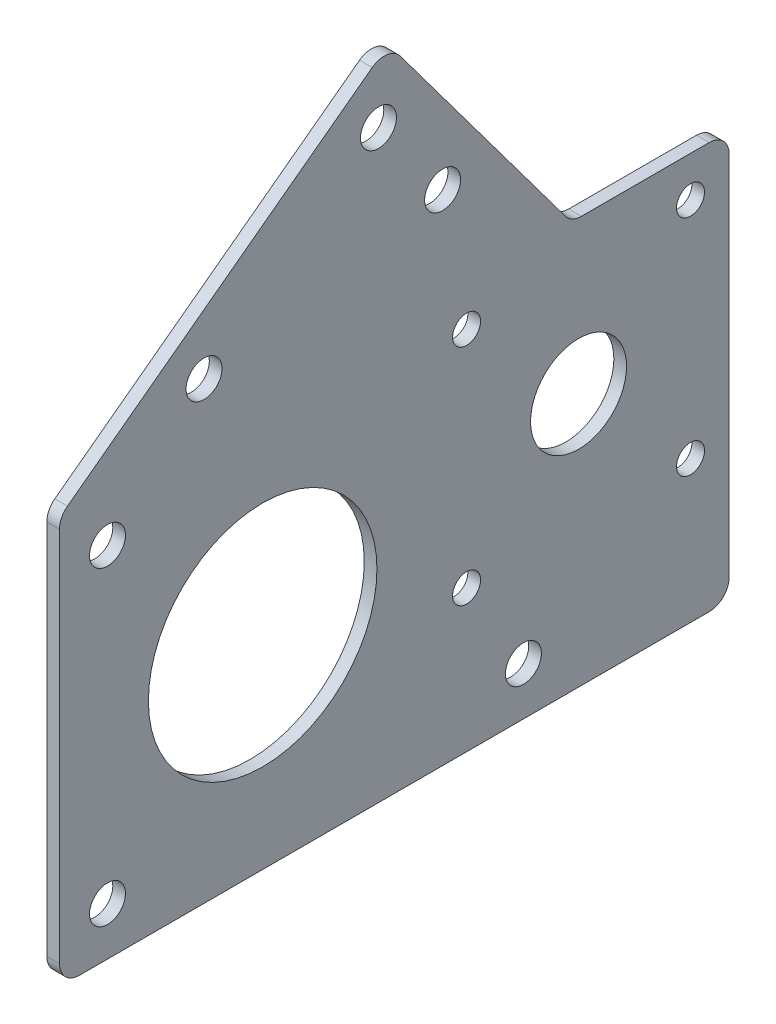
ISO-10303-21;
HEADER;
FILE_DESCRIPTION(('STEP AP214'),'2;1');
FILE_NAME('part.step','',(''),(''),'','','');
FILE_SCHEMA(('AUTOMOTIVE_DESIGN { 1 0 10303 214 1 1 1 1 }'));
ENDSEC;
DATA;
#1=APPLICATION_CONTEXT('core data for automotive mechanical design processes');
#2=APPLICATION_PROTOCOL_DEFINITION('international standard','automotive_design',2000,#1);
#3=PRODUCT_CONTEXT('',#1,'mechanical');
#4=PRODUCT('Part','Part','',(#3));
#5=PRODUCT_RELATED_PRODUCT_CATEGORY('part','',(#4));
#6=PRODUCT_DEFINITION_FORMATION('','',#4);
#7=PRODUCT_DEFINITION_CONTEXT('part definition',#1,'design');
#8=PRODUCT_DEFINITION('design','',#6,#7);
#9=PRODUCT_DEFINITION_SHAPE('','',#8);
#10=(LENGTH_UNIT() NAMED_UNIT(*) SI_UNIT(.MILLI.,.METRE.));
#11=(NAMED_UNIT(*) PLANE_ANGLE_UNIT() SI_UNIT($,.RADIAN.));
#12=(NAMED_UNIT(*) SI_UNIT($,.STERADIAN.) SOLID_ANGLE_UNIT());
#13=UNCERTAINTY_MEASURE_WITH_UNIT(LENGTH_MEASURE(1.E-05),#10,'distance_accuracy_value','');
#14=(GEOMETRIC_REPRESENTATION_CONTEXT(3) GLOBAL_UNCERTAINTY_ASSIGNED_CONTEXT((#13)) GLOBAL_UNIT_ASSIGNED_CONTEXT((#10,
#11,#12)) REPRESENTATION_CONTEXT('',''));
#15=CARTESIAN_POINT('',(0.,0.,0.));
#16=DIRECTION('',(0.,0.,1.));
#17=DIRECTION('',(1.,0.,0.));
#18=AXIS2_PLACEMENT_3D('',#15,#16,#17);
#19=CARTESIAN_POINT('',(1.5875,-22.9,22.9));
#20=DIRECTION('',(-1.,0.,0.));
#21=DIRECTION('',(0.,0.,1.));
#22=AXIS2_PLACEMENT_3D('',#19,#20,#21);
#23=CYLINDRICAL_SURFACE('',#22,2.5);
#24=CARTESIAN_POINT('',(0.,-22.9,22.9));
#25=DIRECTION('',(1.,0.,0.));
#26=DIRECTION('',(0.,0.,-1.));
#27=AXIS2_PLACEMENT_3D('',#24,#25,#26);
#28=CIRCLE('',#27,2.5);
#29=CARTESIAN_POINT('',(0.,-22.9,25.4));
#30=VERTEX_POINT('',#29);
#31=CARTESIAN_POINT('',(0.,-25.4,22.9));
#32=VERTEX_POINT('',#31);
#33=EDGE_CURVE('E199',#30,#32,#28,.T.);
#34=ORIENTED_EDGE('',*,*,#33,.T.);
#35=DIRECTION('',(-1.,0.,0.));
#36=VECTOR('',#35,1.);
#37=CARTESIAN_POINT('',(1.5875,-25.4,22.9));
#38=LINE('',#37,#36);
#39=CARTESIAN_POINT('',(1.5875,-25.4,22.9));
#40=VERTEX_POINT('',#39);
#41=EDGE_CURVE('E11',#40,#32,#38,.T.);
#42=ORIENTED_EDGE('',*,*,#41,.F.);
#43=CARTESIAN_POINT('',(1.5875,-22.9,22.9));
#44=DIRECTION('',(1.,0.,0.));
#45=DIRECTION('',(0.,0.,-1.));
#46=AXIS2_PLACEMENT_3D('',#43,#44,#45);
#47=CIRCLE('',#46,2.5);
#48=CARTESIAN_POINT('',(1.5875,-22.9,25.4));
#49=VERTEX_POINT('',#48);
#50=EDGE_CURVE('E617',#49,#40,#47,.T.);
#51=ORIENTED_EDGE('',*,*,#50,.F.);
#52=DIRECTION('',(-1.,0.,0.));
#53=VECTOR('',#52,1.);
#54=CARTESIAN_POINT('',(1.5875,-22.9,25.4));
#55=LINE('',#54,#53);
#56=EDGE_CURVE('E192',#49,#30,#55,.T.);
#57=ORIENTED_EDGE('',*,*,#56,.T.);
#58=EDGE_LOOP('',(#34,#42,#51,#57));
#59=FACE_BOUND('',#58,.T.);
#60=ADVANCED_FACE('F39',(#59),#23,.T.);
#61=CARTESIAN_POINT('',(1.5875,-25.4,0.));
#62=DIRECTION('',(0.,1.,0.));
#63=DIRECTION('',(0.,0.,1.));
#64=AXIS2_PLACEMENT_3D('',#61,#62,#63);
#65=PLANE('',#64);
#66=DIRECTION('',(0.,0.,-1.));
#67=VECTOR('',#66,1.);
#68=CARTESIAN_POINT('',(0.,-25.4,0.));
#69=LINE('',#68,#67);
#70=CARTESIAN_POINT('',(0.,-25.4,-55.825));
#71=VERTEX_POINT('',#70);
#72=EDGE_CURVE('E202',#32,#71,#69,.T.);
#73=ORIENTED_EDGE('',*,*,#72,.T.);
#74=DIRECTION('',(-1.,0.,0.));
#75=VECTOR('',#74,1.);
#76=CARTESIAN_POINT('',(1.5875,-25.4,-55.825));
#77=LINE('',#76,#75);
#78=CARTESIAN_POINT('',(1.5875,-25.4,-55.825));
#79=VERTEX_POINT('',#78);
#80=EDGE_CURVE('E48',#79,#71,#77,.T.);
#81=ORIENTED_EDGE('',*,*,#80,.F.);
#82=DIRECTION('',(0.,0.,-1.));
#83=VECTOR('',#82,1.);
#84=CARTESIAN_POINT('',(1.5875,-25.4,0.));
#85=LINE('',#84,#83);
#86=EDGE_CURVE('E110',#40,#79,#85,.T.);
#87=ORIENTED_EDGE('',*,*,#86,.F.);
#88=ORIENTED_EDGE('',*,*,#41,.T.);
#89=EDGE_LOOP('',(#73,#81,#87,#88));
#90=FACE_BOUND('',#89,.T.);
#91=ADVANCED_FACE('F326',(#90),#65,.F.);
#92=CARTESIAN_POINT('',(1.5875,-22.9,-55.825));
#93=DIRECTION('',(-1.,0.,0.));
#94=DIRECTION('',(0.,0.,1.));
#95=AXIS2_PLACEMENT_3D('',#92,#93,#94);
#96=CYLINDRICAL_SURFACE('',#95,2.5);
#97=CARTESIAN_POINT('',(0.,-22.9,-55.825));
#98=DIRECTION('',(1.,0.,0.));
#99=DIRECTION('',(0.,0.,-1.));
#100=AXIS2_PLACEMENT_3D('',#97,#98,#99);
#101=CIRCLE('',#100,2.5);
#102=CARTESIAN_POINT('',(0.,-22.9,-58.325));
#103=VERTEX_POINT('',#102);
#104=EDGE_CURVE('E204',#71,#103,#101,.T.);
#105=ORIENTED_EDGE('',*,*,#104,.T.);
#106=DIRECTION('',(-1.,0.,0.));
#107=VECTOR('',#106,1.);
#108=CARTESIAN_POINT('',(1.5875,-22.9,-58.325));
#109=LINE('',#108,#107);
#110=CARTESIAN_POINT('',(1.5875,-22.9,-58.325));
#111=VERTEX_POINT('',#110);
#112=EDGE_CURVE('E271',#111,#103,#109,.T.);
#113=ORIENTED_EDGE('',*,*,#112,.F.);
#114=CARTESIAN_POINT('',(1.5875,-22.9,-55.825));
#115=DIRECTION('',(1.,0.,0.));
#116=DIRECTION('',(0.,0.,-1.));
#117=AXIS2_PLACEMENT_3D('',#114,#115,#116);
#118=CIRCLE('',#117,2.5);
#119=EDGE_CURVE('E279',#79,#111,#118,.T.);
#120=ORIENTED_EDGE('',*,*,#119,.F.);
#121=ORIENTED_EDGE('',*,*,#80,.T.);
#122=EDGE_LOOP('',(#105,#113,#120,#121));
#123=FACE_BOUND('',#122,.T.);
#124=ADVANCED_FACE('F277',(#123),#96,.T.);
#125=CARTESIAN_POINT('',(1.5875,0.,-58.325));
#126=DIRECTION('',(0.,0.,1.));
#127=DIRECTION('',(1.,0.,0.));
#128=AXIS2_PLACEMENT_3D('',#125,#126,#127);
#129=PLANE('',#128);
#130=DIRECTION('',(0.,1.,0.));
#131=VECTOR('',#130,1.);
#132=CARTESIAN_POINT('',(0.,0.,-58.325));
#133=LINE('',#132,#131);
#134=CARTESIAN_POINT('',(0.,22.9,-58.325));
#135=VERTEX_POINT('',#134);
#136=EDGE_CURVE('E206',#103,#135,#133,.T.);
#137=ORIENTED_EDGE('',*,*,#136,.T.);
#138=DIRECTION('',(-1.,0.,0.));
#139=VECTOR('',#138,1.);
#140=CARTESIAN_POINT('',(1.5875,22.9,-58.325));
#141=LINE('',#140,#139);
#142=CARTESIAN_POINT('',(1.5875,22.9,-58.325));
#143=VERTEX_POINT('',#142);
#144=EDGE_CURVE('E269',#143,#135,#141,.T.);
#145=ORIENTED_EDGE('',*,*,#144,.F.);
#146=DIRECTION('',(0.,1.,0.));
#147=VECTOR('',#146,1.);
#148=CARTESIAN_POINT('',(1.5875,0.,-58.325));
#149=LINE('',#148,#147);
#150=EDGE_CURVE('E291',#111,#143,#149,.T.);
#151=ORIENTED_EDGE('',*,*,#150,.F.);
#152=ORIENTED_EDGE('',*,*,#112,.T.);
#153=EDGE_LOOP('',(#137,#145,#151,#152));
#154=FACE_BOUND('',#153,.T.);
#155=ADVANCED_FACE('F288',(#154),#129,.F.);
#156=CARTESIAN_POINT('',(1.5875,22.9,-55.825));
#157=DIRECTION('',(-1.,0.,0.));
#158=DIRECTION('',(0.,0.,1.));
#159=AXIS2_PLACEMENT_3D('',#156,#157,#158);
#160=CYLINDRICAL_SURFACE('',#159,2.5);
#161=CARTESIAN_POINT('',(0.,22.9,-55.825));
#162=DIRECTION('',(1.,0.,0.));
#163=DIRECTION('',(0.,0.,-1.));
#164=AXIS2_PLACEMENT_3D('',#161,#162,#163);
#165=CIRCLE('',#164,2.5);
#166=CARTESIAN_POINT('',(0.,25.4,-55.825));
#167=VERTEX_POINT('',#166);
#168=EDGE_CURVE('E209',#167,#135,#165,.F.);
#169=ORIENTED_EDGE('',*,*,#168,.F.);
#170=DIRECTION('',(-1.,0.,0.));
#171=VECTOR('',#170,1.);
#172=CARTESIAN_POINT('',(1.5875,25.4,-55.825));
#173=LINE('',#172,#171);
#174=CARTESIAN_POINT('',(1.5875,25.4,-55.825));
#175=VERTEX_POINT('',#174);
#176=EDGE_CURVE('E267',#175,#167,#173,.T.);
#177=ORIENTED_EDGE('',*,*,#176,.F.);
#178=CARTESIAN_POINT('',(1.5875,22.9,-55.825));
#179=DIRECTION('',(1.,0.,0.));
#180=DIRECTION('',(0.,0.,-1.));
#181=AXIS2_PLACEMENT_3D('',#178,#179,#180);
#182=CIRCLE('',#181,2.5);
#183=EDGE_CURVE('E293',#175,#143,#182,.F.);
#184=ORIENTED_EDGE('',*,*,#183,.T.);
#185=ORIENTED_EDGE('',*,*,#144,.T.);
#186=EDGE_LOOP('',(#169,#177,#184,#185));
#187=FACE_BOUND('',#186,.T.);
#188=ADVANCED_FACE('F520',(#187),#160,.T.);
#189=CARTESIAN_POINT('',(1.5875,25.4,0.));
#190=DIRECTION('',(0.,1.,0.));
#191=DIRECTION('',(0.,0.,1.));
#192=AXIS2_PLACEMENT_3D('',#189,#190,#191);
#193=PLANE('',#192);
#194=DIRECTION('',(0.,0.,-1.));
#195=VECTOR('',#194,1.);
#196=CARTESIAN_POINT('',(0.,25.4,0.));
#197=LINE('',#196,#195);
#198=CARTESIAN_POINT('',(0.,25.4,-39.8535149472255));
#199=VERTEX_POINT('',#198);
#200=EDGE_CURVE('E212',#199,#167,#197,.T.);
#201=ORIENTED_EDGE('',*,*,#200,.F.);
#202=DIRECTION('',(-1.,0.,0.));
#203=VECTOR('',#202,1.);
#204=CARTESIAN_POINT('',(1.5875,25.4,-39.8535149472255));
#205=LINE('',#204,#203);
#206=CARTESIAN_POINT('',(1.5875,25.4,-39.8535149472255));
#207=VERTEX_POINT('',#206);
#208=EDGE_CURVE('E265',#207,#199,#205,.T.);
#209=ORIENTED_EDGE('',*,*,#208,.F.);
#210=DIRECTION('',(0.,0.,-1.));
#211=VECTOR('',#210,1.);
#212=CARTESIAN_POINT('',(1.5875,25.4,0.));
#213=LINE('',#212,#211);
#214=EDGE_CURVE('E295',#207,#175,#213,.T.);
#215=ORIENTED_EDGE('',*,*,#214,.T.);
#216=ORIENTED_EDGE('',*,*,#176,.T.);
#217=EDGE_LOOP('',(#201,#209,#215,#216));
#218=FACE_BOUND('',#217,.T.);
#219=ADVANCED_FACE('F512',(#218),#193,.T.);
#220=CARTESIAN_POINT('',(1.5875,27.9,-39.8535149472255));
#221=DIRECTION('',(-1.,0.,0.));
#222=DIRECTION('',(0.,0.,1.));
#223=AXIS2_PLACEMENT_3D('',#220,#221,#222);
#224=CYLINDRICAL_SURFACE('',#223,2.49999999999999);
#225=CARTESIAN_POINT('',(0.,27.9,-39.8535149472255));
#226=DIRECTION('',(1.,0.,0.));
#227=DIRECTION('',(0.,0.,-1.));
#228=AXIS2_PLACEMENT_3D('',#225,#226,#227);
#229=CIRCLE('',#228,2.49999999999999);
#230=CARTESIAN_POINT('',(0.,26.4045003890553,-37.8501475536444));
#231=VERTEX_POINT('',#230);
#232=EDGE_CURVE('E215',#231,#199,#229,.T.);
#233=ORIENTED_EDGE('',*,*,#232,.F.);
#234=DIRECTION('',(-1.,0.,0.));
#235=VECTOR('',#234,1.);
#236=CARTESIAN_POINT('',(1.5875,26.4045003890553,-37.8501475536444));
#237=LINE('',#236,#235);
#238=CARTESIAN_POINT('',(1.5875,26.4045003890553,-37.8501475536444));
#239=VERTEX_POINT('',#238);
#240=EDGE_CURVE('E263',#239,#231,#237,.T.);
#241=ORIENTED_EDGE('',*,*,#240,.F.);
#242=CARTESIAN_POINT('',(1.5875,27.9,-39.8535149472255));
#243=DIRECTION('',(1.,0.,0.));
#244=DIRECTION('',(0.,0.,-1.));
#245=AXIS2_PLACEMENT_3D('',#242,#243,#244);
#246=CIRCLE('',#245,2.49999999999999);
#247=EDGE_CURVE('E302',#239,#207,#246,.T.);
#248=ORIENTED_EDGE('',*,*,#247,.T.);
#249=ORIENTED_EDGE('',*,*,#208,.T.);
#250=EDGE_LOOP('',(#233,#241,#248,#249));
#251=FACE_BOUND('',#250,.T.);
#252=ADVANCED_FACE('F312',(#251),#224,.F.);
#253=CARTESIAN_POINT('',(1.5875,27.5927267006994,-36.9631450036021));
#254=DIRECTION('',(0.,0.598199844377869,-0.80134695743248));
#255=DIRECTION('',(0.,0.80134695743248,0.598199844377869));
#256=AXIS2_PLACEMENT_3D('',#253,#254,#255);
#257=PLANE('',#256);
#258=DIRECTION('',(0.,-0.80134695743248,-0.598199844377869));
#259=VECTOR('',#258,1.);
#260=CARTESIAN_POINT('',(0.,27.5927267006994,-36.9631450036021));
#261=LINE('',#260,#259);
#262=CARTESIAN_POINT('',(0.,54.0760326210612,-17.1935441668675));
#263=VERTEX_POINT('',#262);
#264=EDGE_CURVE('E218',#263,#231,#261,.T.);
#265=ORIENTED_EDGE('',*,*,#264,.F.);
#266=DIRECTION('',(-1.,0.,0.));
#267=VECTOR('',#266,1.);
#268=CARTESIAN_POINT('',(1.5875,54.0760326210612,-17.1935441668675));
#269=LINE('',#268,#267);
#270=CARTESIAN_POINT('',(1.5875,54.0760326210612,-17.1935441668675));
#271=VERTEX_POINT('',#270);
#272=EDGE_CURVE('E261',#271,#263,#269,.T.);
#273=ORIENTED_EDGE('',*,*,#272,.F.);
#274=DIRECTION('',(0.,-0.80134695743248,-0.598199844377869));
#275=VECTOR('',#274,1.);
#276=CARTESIAN_POINT('',(1.5875,27.5927267006994,-36.9631450036021));
#277=LINE('',#276,#275);
#278=EDGE_CURVE('E157',#271,#239,#277,.T.);
#279=ORIENTED_EDGE('',*,*,#278,.T.);
#280=ORIENTED_EDGE('',*,*,#240,.T.);
#281=EDGE_LOOP('',(#265,#273,#279,#280));
#282=FACE_BOUND('',#281,.T.);
#283=ADVANCED_FACE('F307',(#282),#257,.T.);
#284=CARTESIAN_POINT('',(1.5875,52.5805330101165,-15.1901767732863));
#285=DIRECTION('',(-1.,0.,0.));
#286=DIRECTION('',(0.,0.,1.));
#287=AXIS2_PLACEMENT_3D('',#284,#285,#286);
#288=CYLINDRICAL_SURFACE('',#287,2.5);
#289=CARTESIAN_POINT('',(0.,52.5805330101165,-15.1901767732863));
#290=DIRECTION('',(1.,0.,0.));
#291=DIRECTION('',(0.,0.,-1.));
#292=AXIS2_PLACEMENT_3D('',#289,#290,#291);
#293=CIRCLE('',#292,2.5);
#294=CARTESIAN_POINT('',(0.,54.5839004036977,-13.6946771623416));
#295=VERTEX_POINT('',#294);
#296=EDGE_CURVE('E221',#263,#295,#293,.T.);
#297=ORIENTED_EDGE('',*,*,#296,.T.);
#298=DIRECTION('',(-1.,0.,0.));
#299=VECTOR('',#298,1.);
#300=CARTESIAN_POINT('',(1.5875,54.5839004036977,-13.6946771623416));
#301=LINE('',#300,#299);
#302=CARTESIAN_POINT('',(1.5875,54.5839004036977,-13.6946771623416));
#303=VERTEX_POINT('',#302);
#304=EDGE_CURVE('E144',#303,#295,#301,.T.);
#305=ORIENTED_EDGE('',*,*,#304,.F.);
#306=CARTESIAN_POINT('',(1.5875,52.5805330101165,-15.1901767732863));
#307=DIRECTION('',(1.,0.,0.));
#308=DIRECTION('',(0.,0.,-1.));
#309=AXIS2_PLACEMENT_3D('',#306,#307,#308);
#310=CIRCLE('',#309,2.5);
#311=EDGE_CURVE('E154',#271,#303,#310,.T.);
#312=ORIENTED_EDGE('',*,*,#311,.F.);
#313=ORIENTED_EDGE('',*,*,#272,.T.);
#314=EDGE_LOOP('',(#297,#305,#312,#313));
#315=FACE_BOUND('',#314,.T.);
#316=ADVANCED_FACE('F316',(#315),#288,.T.);
#317=CARTESIAN_POINT('',(1.5875,28.4866733139431,21.2651004476793));
#318=DIRECTION('',(0.,0.801346957432481,0.598199844377868));
#319=DIRECTION('',(0.,-0.598199844377868,0.801346957432481));
#320=AXIS2_PLACEMENT_3D('',#317,#318,#319);
#321=PLANE('',#320);
#322=DIRECTION('',(0.,0.598199844377868,-0.801346957432481));
#323=VECTOR('',#322,1.);
#324=CARTESIAN_POINT('',(0.,28.4866733139431,21.2651004476793));
#325=LINE('',#324,#323);
#326=CARTESIAN_POINT('',(0.,26.1498524463557,24.3954996109447));
#327=VERTEX_POINT('',#326);
#328=EDGE_CURVE('E143',#327,#295,#325,.T.);
#329=ORIENTED_EDGE('',*,*,#328,.F.);
#330=DIRECTION('',(-1.,0.,0.));
#331=VECTOR('',#330,1.);
#332=CARTESIAN_POINT('',(1.5875,26.1498524463557,24.3954996109447));
#333=LINE('',#332,#331);
#334=CARTESIAN_POINT('',(1.5875,26.1498524463557,24.3954996109447));
#335=VERTEX_POINT('',#334);
#336=EDGE_CURVE('E137',#335,#327,#333,.T.);
#337=ORIENTED_EDGE('',*,*,#336,.F.);
#338=DIRECTION('',(0.,0.598199844377868,-0.801346957432481));
#339=VECTOR('',#338,1.);
#340=CARTESIAN_POINT('',(1.5875,28.4866733139431,21.2651004476793));
#341=LINE('',#340,#339);
#342=EDGE_CURVE('E141',#335,#303,#341,.T.);
#343=ORIENTED_EDGE('',*,*,#342,.T.);
#344=ORIENTED_EDGE('',*,*,#304,.T.);
#345=EDGE_LOOP('',(#329,#337,#343,#344));
#346=FACE_BOUND('',#345,.T.);
#347=ADVANCED_FACE('F139',(#346),#321,.T.);
#348=CARTESIAN_POINT('',(1.5875,24.1464850527745,22.9));
#349=DIRECTION('',(-1.,0.,0.));
#350=DIRECTION('',(0.,0.,1.));
#351=AXIS2_PLACEMENT_3D('',#348,#349,#350);
#352=CYLINDRICAL_SURFACE('',#351,2.5);
#353=CARTESIAN_POINT('',(0.,24.1464850527745,22.9));
#354=DIRECTION('',(1.,0.,0.));
#355=DIRECTION('',(0.,0.,-1.));
#356=AXIS2_PLACEMENT_3D('',#353,#354,#355);
#357=CIRCLE('',#356,2.5);
#358=CARTESIAN_POINT('',(0.,24.1464850527744,25.4));
#359=VERTEX_POINT('',#358);
#360=EDGE_CURVE('E96',#327,#359,#357,.T.);
#361=ORIENTED_EDGE('',*,*,#360,.T.);
#362=DIRECTION('',(-1.,0.,0.));
#363=VECTOR('',#362,1.);
#364=CARTESIAN_POINT('',(1.5875,24.1464850527744,25.4));
#365=LINE('',#364,#363);
#366=CARTESIAN_POINT('',(1.5875,24.1464850527744,25.4));
#367=VERTEX_POINT('',#366);
#368=EDGE_CURVE('E145',#367,#359,#365,.T.);
#369=ORIENTED_EDGE('',*,*,#368,.F.);
#370=CARTESIAN_POINT('',(1.5875,24.1464850527745,22.9));
#371=DIRECTION('',(1.,0.,0.));
#372=DIRECTION('',(0.,0.,-1.));
#373=AXIS2_PLACEMENT_3D('',#370,#371,#372);
#374=CIRCLE('',#373,2.5);
#375=EDGE_CURVE('E147',#335,#367,#374,.T.);
#376=ORIENTED_EDGE('',*,*,#375,.F.);
#377=ORIENTED_EDGE('',*,*,#336,.T.);
#378=EDGE_LOOP('',(#361,#369,#376,#377));
#379=FACE_BOUND('',#378,.T.);
#380=ADVANCED_FACE('F148',(#379),#352,.T.);
#381=CARTESIAN_POINT('',(1.5875,-19.4,19.4));
#382=DIRECTION('',(-1.,0.,0.));
#383=DIRECTION('',(0.,0.,1.));
#384=AXIS2_PLACEMENT_3D('',#381,#382,#383);
#385=CYLINDRICAL_SURFACE('',#384,2.25);
#386=CARTESIAN_POINT('',(1.5875,-19.4,19.4));
#387=DIRECTION('',(1.,0.,0.));
#388=DIRECTION('',(0.,0.,-1.));
#389=AXIS2_PLACEMENT_3D('',#386,#387,#388);
#390=CIRCLE('',#389,2.25);
#391=CARTESIAN_POINT('',(1.5875,-19.4,17.15));
#392=VERTEX_POINT('',#391);
#393=EDGE_CURVE('E186',#392,#392,#390,.T.);
#394=ORIENTED_EDGE('',*,*,#393,.T.);
#395=EDGE_LOOP('',(#394));
#396=FACE_BOUND('',#395,.T.);
#397=CARTESIAN_POINT('',(0.,-19.4,19.4));
#398=DIRECTION('',(1.,0.,0.));
#399=DIRECTION('',(0.,0.,-1.));
#400=AXIS2_PLACEMENT_3D('',#397,#398,#399);
#401=CIRCLE('',#400,2.25);
#402=CARTESIAN_POINT('',(0.,-19.4,17.15));
#403=VERTEX_POINT('',#402);
#404=EDGE_CURVE('E251',#403,#403,#401,.T.);
#405=ORIENTED_EDGE('',*,*,#404,.F.);
#406=EDGE_LOOP('',(#405));
#407=FACE_BOUND('',#406,.T.);
#408=ADVANCED_FACE('F364',(#396,#407),#385,.F.);
#409=CARTESIAN_POINT('',(1.5875,0.,0.));
#410=DIRECTION('',(-1.,0.,0.));
#411=DIRECTION('',(0.,0.,1.));
#412=AXIS2_PLACEMENT_3D('',#409,#410,#411);
#413=CYLINDRICAL_SURFACE('',#412,14.2875);
#414=CARTESIAN_POINT('',(1.5875,0.,0.));
#415=DIRECTION('',(1.,0.,0.));
#416=DIRECTION('',(0.,0.,-1.));
#417=AXIS2_PLACEMENT_3D('',#414,#415,#416);
#418=CIRCLE('',#417,14.2875);
#419=CARTESIAN_POINT('',(1.5875,0.,-14.2875));
#420=VERTEX_POINT('',#419);
#421=EDGE_CURVE('E183',#420,#420,#418,.T.);
#422=ORIENTED_EDGE('',*,*,#421,.T.);
#423=EDGE_LOOP('',(#422));
#424=FACE_BOUND('',#423,.T.);
#425=CARTESIAN_POINT('',(0.,0.,0.));
#426=DIRECTION('',(1.,0.,0.));
#427=DIRECTION('',(0.,0.,-1.));
#428=AXIS2_PLACEMENT_3D('',#425,#426,#427);
#429=CIRCLE('',#428,14.2875);
#430=CARTESIAN_POINT('',(0.,0.,-14.2875));
#431=VERTEX_POINT('',#430);
#432=EDGE_CURVE('E248',#431,#431,#429,.T.);
#433=ORIENTED_EDGE('',*,*,#432,.F.);
#434=EDGE_LOOP('',(#433));
#435=FACE_BOUND('',#434,.T.);
#436=ADVANCED_FACE('F367',(#424,#435),#413,.F.);
#437=CARTESIAN_POINT('',(1.5875,36.9440699741851,-22.4950397922586));
#438=DIRECTION('',(-1.,0.,0.));
#439=DIRECTION('',(0.,0.,1.));
#440=AXIS2_PLACEMENT_3D('',#437,#438,#439);
#441=CYLINDRICAL_SURFACE('',#440,2.25);
#442=CARTESIAN_POINT('',(1.5875,36.9440699741851,-22.4950397922586));
#443=DIRECTION('',(1.,0.,0.));
#444=DIRECTION('',(0.,0.,-1.));
#445=AXIS2_PLACEMENT_3D('',#442,#443,#444);
#446=CIRCLE('',#445,2.25);
#447=CARTESIAN_POINT('',(1.5875,36.9440699741851,-24.7450397922586));
#448=VERTEX_POINT('',#447);
#449=EDGE_CURVE('E180',#448,#448,#446,.T.);
#450=ORIENTED_EDGE('',*,*,#449,.T.);
#451=EDGE_LOOP('',(#450));
#452=FACE_BOUND('',#451,.T.);
#453=CARTESIAN_POINT('',(0.,36.9440699741851,-22.4950397922586));
#454=DIRECTION('',(1.,0.,0.));
#455=DIRECTION('',(0.,0.,-1.));
#456=AXIS2_PLACEMENT_3D('',#453,#454,#455);
#457=CIRCLE('',#456,2.25);
#458=CARTESIAN_POINT('',(0.,36.9440699741851,-24.7450397922586));
#459=VERTEX_POINT('',#458);
#460=EDGE_CURVE('E245',#459,#459,#457,.T.);
#461=ORIENTED_EDGE('',*,*,#460,.F.);
#462=EDGE_LOOP('',(#461));
#463=FACE_BOUND('',#462,.T.);
#464=ADVANCED_FACE('F371',(#452,#463),#441,.F.);
#465=CARTESIAN_POINT('',(1.5875,47.6821192037804,-14.4791618775951));
#466=DIRECTION('',(-1.,0.,0.));
#467=DIRECTION('',(0.,0.,1.));
#468=AXIS2_PLACEMENT_3D('',#465,#466,#467);
#469=CYLINDRICAL_SURFACE('',#468,2.25);
#470=CARTESIAN_POINT('',(1.5875,47.6821192037804,-14.4791618775951));
#471=DIRECTION('',(1.,0.,0.));
#472=DIRECTION('',(0.,0.,-1.));
#473=AXIS2_PLACEMENT_3D('',#470,#471,#472);
#474=CIRCLE('',#473,2.25);
#475=CARTESIAN_POINT('',(1.5875,47.6821192037804,-16.7291618775951));
#476=VERTEX_POINT('',#475);
#477=EDGE_CURVE('E177',#476,#476,#474,.T.);
#478=ORIENTED_EDGE('',*,*,#477,.T.);
#479=EDGE_LOOP('',(#478));
#480=FACE_BOUND('',#479,.T.);
#481=CARTESIAN_POINT('',(0.,47.6821192037804,-14.4791618775951));
#482=DIRECTION('',(1.,0.,0.));
#483=DIRECTION('',(0.,0.,-1.));
#484=AXIS2_PLACEMENT_3D('',#481,#482,#483);
#485=CIRCLE('',#484,2.25);
#486=CARTESIAN_POINT('',(0.,47.6821192037804,-16.7291618775951));
#487=VERTEX_POINT('',#486);
#488=EDGE_CURVE('E242',#487,#487,#485,.T.);
#489=ORIENTED_EDGE('',*,*,#488,.F.);
#490=EDGE_LOOP('',(#489));
#491=FACE_BOUND('',#490,.T.);
#492=ADVANCED_FACE('F375',(#480,#491),#469,.F.);
#493=CARTESIAN_POINT('',(1.5875,31.4,7.33232270758054));
#494=DIRECTION('',(-1.,0.,0.));
#495=DIRECTION('',(0.,0.,1.));
#496=AXIS2_PLACEMENT_3D('',#493,#494,#495);
#497=CYLINDRICAL_SURFACE('',#496,2.25);
#498=CARTESIAN_POINT('',(1.5875,31.4,7.33232270758054));
#499=DIRECTION('',(1.,0.,0.));
#500=DIRECTION('',(0.,0.,-1.));
#501=AXIS2_PLACEMENT_3D('',#498,#499,#500);
#502=CIRCLE('',#501,2.25);
#503=CARTESIAN_POINT('',(1.5875,31.4,5.08232270758054));
#504=VERTEX_POINT('',#503);
#505=EDGE_CURVE('E174',#504,#504,#502,.T.);
#506=ORIENTED_EDGE('',*,*,#505,.T.);
#507=EDGE_LOOP('',(#506));
#508=FACE_BOUND('',#507,.T.);
#509=CARTESIAN_POINT('',(0.,31.4,7.33232270758054));
#510=DIRECTION('',(1.,0.,0.));
#511=DIRECTION('',(0.,0.,-1.));
#512=AXIS2_PLACEMENT_3D('',#509,#510,#511);
#513=CIRCLE('',#512,2.25);
#514=CARTESIAN_POINT('',(0.,31.4,5.08232270758054));
#515=VERTEX_POINT('',#514);
#516=EDGE_CURVE('E239',#515,#515,#513,.T.);
#517=ORIENTED_EDGE('',*,*,#516,.F.);
#518=EDGE_LOOP('',(#517));
#519=FACE_BOUND('',#518,.T.);
#520=ADVANCED_FACE('F379',(#508,#519),#497,.F.);
#521=CARTESIAN_POINT('',(1.5875,19.4,19.4));
#522=DIRECTION('',(-1.,0.,0.));
#523=DIRECTION('',(0.,0.,1.));
#524=AXIS2_PLACEMENT_3D('',#521,#522,#523);
#525=CYLINDRICAL_SURFACE('',#524,2.25);
#526=CARTESIAN_POINT('',(1.5875,19.4,19.4));
#527=DIRECTION('',(1.,0.,0.));
#528=DIRECTION('',(0.,0.,-1.));
#529=AXIS2_PLACEMENT_3D('',#526,#527,#528);
#530=CIRCLE('',#529,2.25);
#531=CARTESIAN_POINT('',(1.5875,19.4,17.15));
#532=VERTEX_POINT('',#531);
#533=EDGE_CURVE('E171',#532,#532,#530,.T.);
#534=ORIENTED_EDGE('',*,*,#533,.T.);
#535=EDGE_LOOP('',(#534));
#536=FACE_BOUND('',#535,.T.);
#537=CARTESIAN_POINT('',(0.,19.4,19.4));
#538=DIRECTION('',(1.,0.,0.));
#539=DIRECTION('',(0.,0.,-1.));
#540=AXIS2_PLACEMENT_3D('',#537,#538,#539);
#541=CIRCLE('',#540,2.25);
#542=CARTESIAN_POINT('',(0.,19.4,17.15));
#543=VERTEX_POINT('',#542);
#544=EDGE_CURVE('E236',#543,#543,#541,.T.);
#545=ORIENTED_EDGE('',*,*,#544,.F.);
#546=EDGE_LOOP('',(#545));
#547=FACE_BOUND('',#546,.T.);
#548=ADVANCED_FACE('F383',(#536,#547),#525,.F.);
#549=CARTESIAN_POINT('',(1.5875,-7.64999999999998,-53.4927524996676));
#550=DIRECTION('',(-1.,0.,0.));
#551=DIRECTION('',(0.,0.,1.));
#552=AXIS2_PLACEMENT_3D('',#549,#550,#551);
#553=CYLINDRICAL_SURFACE('',#552,1.75);
#554=CARTESIAN_POINT('',(1.5875,-7.64999999999998,-53.4927524996676));
#555=DIRECTION('',(1.,0.,0.));
#556=DIRECTION('',(0.,0.,-1.));
#557=AXIS2_PLACEMENT_3D('',#554,#555,#556);
#558=CIRCLE('',#557,1.75);
#559=CARTESIAN_POINT('',(1.5875,-7.64999999999998,-55.2427524996676));
#560=VERTEX_POINT('',#559);
#561=EDGE_CURVE('E168',#560,#560,#558,.T.);
#562=ORIENTED_EDGE('',*,*,#561,.T.);
#563=EDGE_LOOP('',(#562));
#564=FACE_BOUND('',#563,.T.);
#565=CARTESIAN_POINT('',(0.,-7.64999999999998,-53.4927524996676));
#566=DIRECTION('',(1.,0.,0.));
#567=DIRECTION('',(0.,0.,-1.));
#568=AXIS2_PLACEMENT_3D('',#565,#566,#567);
#569=CIRCLE('',#568,1.75);
#570=CARTESIAN_POINT('',(0.,-7.64999999999998,-55.2427524996676));
#571=VERTEX_POINT('',#570);
#572=EDGE_CURVE('E233',#571,#571,#569,.T.);
#573=ORIENTED_EDGE('',*,*,#572,.F.);
#574=EDGE_LOOP('',(#573));
#575=FACE_BOUND('',#574,.T.);
#576=ADVANCED_FACE('F387',(#564,#575),#553,.F.);
#577=CARTESIAN_POINT('',(1.5875,-7.64999999999998,-25.4927524996677));
#578=DIRECTION('',(-1.,0.,0.));
#579=DIRECTION('',(0.,0.,1.));
#580=AXIS2_PLACEMENT_3D('',#577,#578,#579);
#581=CYLINDRICAL_SURFACE('',#580,1.75);
#582=CARTESIAN_POINT('',(1.5875,-7.64999999999998,-25.4927524996677));
#583=DIRECTION('',(1.,0.,0.));
#584=DIRECTION('',(0.,0.,-1.));
#585=AXIS2_PLACEMENT_3D('',#582,#583,#584);
#586=CIRCLE('',#585,1.75);
#587=CARTESIAN_POINT('',(1.5875,-7.64999999999998,-27.2427524996677));
#588=VERTEX_POINT('',#587);
#589=EDGE_CURVE('E165',#588,#588,#586,.T.);
#590=ORIENTED_EDGE('',*,*,#589,.T.);
#591=EDGE_LOOP('',(#590));
#592=FACE_BOUND('',#591,.T.);
#593=CARTESIAN_POINT('',(0.,-7.64999999999998,-25.4927524996677));
#594=DIRECTION('',(1.,0.,0.));
#595=DIRECTION('',(0.,0.,-1.));
#596=AXIS2_PLACEMENT_3D('',#593,#594,#595);
#597=CIRCLE('',#596,1.75);
#598=CARTESIAN_POINT('',(0.,-7.64999999999998,-27.2427524996677));
#599=VERTEX_POINT('',#598);
#600=EDGE_CURVE('E230',#599,#599,#597,.T.);
#601=ORIENTED_EDGE('',*,*,#600,.F.);
#602=EDGE_LOOP('',(#601));
#603=FACE_BOUND('',#602,.T.);
#604=ADVANCED_FACE('F391',(#592,#603),#581,.F.);
#605=CARTESIAN_POINT('',(1.5875,20.35,-53.4927524996675));
#606=DIRECTION('',(-1.,0.,0.));
#607=DIRECTION('',(0.,0.,1.));
#608=AXIS2_PLACEMENT_3D('',#605,#606,#607);
#609=CYLINDRICAL_SURFACE('',#608,1.75);
#610=CARTESIAN_POINT('',(1.5875,20.35,-53.4927524996675));
#611=DIRECTION('',(1.,0.,0.));
#612=DIRECTION('',(0.,0.,-1.));
#613=AXIS2_PLACEMENT_3D('',#610,#611,#612);
#614=CIRCLE('',#613,1.75);
#615=CARTESIAN_POINT('',(1.5875,20.35,-55.2427524996675));
#616=VERTEX_POINT('',#615);
#617=EDGE_CURVE('E162',#616,#616,#614,.T.);
#618=ORIENTED_EDGE('',*,*,#617,.T.);
#619=EDGE_LOOP('',(#618));
#620=FACE_BOUND('',#619,.T.);
#621=CARTESIAN_POINT('',(0.,20.35,-53.4927524996675));
#622=DIRECTION('',(1.,0.,0.));
#623=DIRECTION('',(0.,0.,-1.));
#624=AXIS2_PLACEMENT_3D('',#621,#622,#623);
#625=CIRCLE('',#624,1.75);
#626=CARTESIAN_POINT('',(0.,20.35,-55.2427524996675));
#627=VERTEX_POINT('',#626);
#628=EDGE_CURVE('E227',#627,#627,#625,.T.);
#629=ORIENTED_EDGE('',*,*,#628,.F.);
#630=EDGE_LOOP('',(#629));
#631=FACE_BOUND('',#630,.T.);
#632=ADVANCED_FACE('F344',(#620,#631),#609,.F.);
#633=CARTESIAN_POINT('',(1.5875,0.,25.4));
#634=DIRECTION('',(0.,0.,-1.));
#635=DIRECTION('',(0.,1.,0.));
#636=AXIS2_PLACEMENT_3D('',#633,#634,#635);
#637=PLANE('',#636);
#638=DIRECTION('',(0.,-1.,0.));
#639=VECTOR('',#638,1.);
#640=CARTESIAN_POINT('',(0.,0.,25.4));
#641=LINE('',#640,#639);
#642=EDGE_CURVE('E102',#359,#30,#641,.T.);
#643=ORIENTED_EDGE('',*,*,#642,.T.);
#644=ORIENTED_EDGE('',*,*,#56,.F.);
#645=DIRECTION('',(0.,-1.,0.));
#646=VECTOR('',#645,1.);
#647=CARTESIAN_POINT('',(1.5875,0.,25.4));
#648=LINE('',#647,#646);
#649=EDGE_CURVE('E56',#367,#49,#648,.T.);
#650=ORIENTED_EDGE('',*,*,#649,.F.);
#651=ORIENTED_EDGE('',*,*,#368,.T.);
#652=EDGE_LOOP('',(#643,#644,#650,#651));
#653=FACE_BOUND('',#652,.T.);
#654=ADVANCED_FACE('F336',(#653),#637,.F.);
#655=CARTESIAN_POINT('',(1.5875,20.35,-25.4927524996676));
#656=DIRECTION('',(-1.,0.,0.));
#657=DIRECTION('',(0.,0.,1.));
#658=AXIS2_PLACEMENT_3D('',#655,#656,#657);
#659=CYLINDRICAL_SURFACE('',#658,1.75);
#660=CARTESIAN_POINT('',(1.5875,20.35,-25.4927524996676));
#661=DIRECTION('',(1.,0.,0.));
#662=DIRECTION('',(0.,0.,-1.));
#663=AXIS2_PLACEMENT_3D('',#660,#661,#662);
#664=CIRCLE('',#663,1.75);
#665=CARTESIAN_POINT('',(1.5875,20.35,-27.2427524996676));
#666=VERTEX_POINT('',#665);
#667=EDGE_CURVE('E349',#666,#666,#664,.T.);
#668=ORIENTED_EDGE('',*,*,#667,.T.);
#669=EDGE_LOOP('',(#668));
#670=FACE_BOUND('',#669,.T.);
#671=CARTESIAN_POINT('',(0.,20.35,-25.4927524996676));
#672=DIRECTION('',(1.,0.,0.));
#673=DIRECTION('',(0.,0.,-1.));
#674=AXIS2_PLACEMENT_3D('',#671,#672,#673);
#675=CIRCLE('',#674,1.75);
#676=CARTESIAN_POINT('',(0.,20.35,-27.2427524996676));
#677=VERTEX_POINT('',#676);
#678=EDGE_CURVE('E196',#677,#677,#675,.T.);
#679=ORIENTED_EDGE('',*,*,#678,.F.);
#680=EDGE_LOOP('',(#679));
#681=FACE_BOUND('',#680,.T.);
#682=ADVANCED_FACE('F334',(#670,#681),#659,.F.);
#683=CARTESIAN_POINT('',(1.5875,6.35,-39.4927524996676));
#684=DIRECTION('',(-1.,0.,0.));
#685=DIRECTION('',(0.,0.,1.));
#686=AXIS2_PLACEMENT_3D('',#683,#684,#685);
#687=CYLINDRICAL_SURFACE('',#686,6.00000000000002);
#688=CARTESIAN_POINT('',(1.5875,6.35,-39.4927524996676));
#689=DIRECTION('',(1.,0.,0.));
#690=DIRECTION('',(0.,0.,-1.));
#691=AXIS2_PLACEMENT_3D('',#688,#689,#690);
#692=CIRCLE('',#691,6.00000000000002);
#693=CARTESIAN_POINT('',(1.5875,6.35,-45.4927524996676));
#694=VERTEX_POINT('',#693);
#695=EDGE_CURVE('E257',#694,#694,#692,.T.);
#696=ORIENTED_EDGE('',*,*,#695,.T.);
#697=EDGE_LOOP('',(#696));
#698=FACE_BOUND('',#697,.T.);
#699=CARTESIAN_POINT('',(0.,6.35,-39.4927524996676));
#700=DIRECTION('',(1.,0.,0.));
#701=DIRECTION('',(0.,0.,-1.));
#702=AXIS2_PLACEMENT_3D('',#699,#700,#701);
#703=CIRCLE('',#702,6.00000000000002);
#704=CARTESIAN_POINT('',(0.,6.35,-45.4927524996676));
#705=VERTEX_POINT('',#704);
#706=EDGE_CURVE('E193',#705,#705,#703,.T.);
#707=ORIENTED_EDGE('',*,*,#706,.F.);
#708=EDGE_LOOP('',(#707));
#709=FACE_BOUND('',#708,.T.);
#710=ADVANCED_FACE('F41',(#698,#709),#687,.F.);
#711=CARTESIAN_POINT('',(1.5875,-19.4,-32.6));
#712=DIRECTION('',(-1.,0.,0.));
#713=DIRECTION('',(0.,0.,1.));
#714=AXIS2_PLACEMENT_3D('',#711,#712,#713);
#715=CYLINDRICAL_SURFACE('',#714,2.25);
#716=CARTESIAN_POINT('',(1.5875,-19.4,-32.6));
#717=DIRECTION('',(1.,0.,0.));
#718=DIRECTION('',(0.,0.,-1.));
#719=AXIS2_PLACEMENT_3D('',#716,#717,#718);
#720=CIRCLE('',#719,2.25);
#721=CARTESIAN_POINT('',(1.5875,-19.4,-34.85));
#722=VERTEX_POINT('',#721);
#723=EDGE_CURVE('E189',#722,#722,#720,.T.);
#724=ORIENTED_EDGE('',*,*,#723,.T.);
#725=EDGE_LOOP('',(#724));
#726=FACE_BOUND('',#725,.T.);
#727=CARTESIAN_POINT('',(0.,-19.4,-32.6));
#728=DIRECTION('',(1.,0.,0.));
#729=DIRECTION('',(0.,0.,-1.));
#730=AXIS2_PLACEMENT_3D('',#727,#728,#729);
#731=CIRCLE('',#730,2.25);
#732=CARTESIAN_POINT('',(0.,-19.4,-34.85));
#733=VERTEX_POINT('',#732);
#734=EDGE_CURVE('E254',#733,#733,#731,.T.);
#735=ORIENTED_EDGE('',*,*,#734,.F.);
#736=EDGE_LOOP('',(#735));
#737=FACE_BOUND('',#736,.T.);
#738=ADVANCED_FACE('F342',(#726,#737),#715,.F.);
#739=CARTESIAN_POINT('',(1.5875,0.,0.));
#740=DIRECTION('',(1.,0.,0.));
#741=DIRECTION('',(0.,0.,-1.));
#742=AXIS2_PLACEMENT_3D('',#739,#740,#741);
#743=PLANE('',#742);
#744=ORIENTED_EDGE('',*,*,#695,.F.);
#745=EDGE_LOOP('',(#744));
#746=FACE_BOUND('',#745,.T.);
#747=ORIENTED_EDGE('',*,*,#667,.F.);
#748=EDGE_LOOP('',(#747));
#749=FACE_BOUND('',#748,.T.);
#750=ORIENTED_EDGE('',*,*,#50,.T.);
#751=ORIENTED_EDGE('',*,*,#86,.T.);
#752=ORIENTED_EDGE('',*,*,#119,.T.);
#753=ORIENTED_EDGE('',*,*,#150,.T.);
#754=ORIENTED_EDGE('',*,*,#183,.F.);
#755=ORIENTED_EDGE('',*,*,#214,.F.);
#756=ORIENTED_EDGE('',*,*,#247,.F.);
#757=ORIENTED_EDGE('',*,*,#278,.F.);
#758=ORIENTED_EDGE('',*,*,#311,.T.);
#759=ORIENTED_EDGE('',*,*,#342,.F.);
#760=ORIENTED_EDGE('',*,*,#375,.T.);
#761=ORIENTED_EDGE('',*,*,#649,.T.);
#762=EDGE_LOOP('',(#750,#751,#752,#753,#754,#755,#756,#757,#758,#759,#760,#761));
#763=FACE_BOUND('',#762,.T.);
#764=ORIENTED_EDGE('',*,*,#617,.F.);
#765=EDGE_LOOP('',(#764));
#766=FACE_BOUND('',#765,.T.);
#767=ORIENTED_EDGE('',*,*,#589,.F.);
#768=EDGE_LOOP('',(#767));
#769=FACE_BOUND('',#768,.T.);
#770=ORIENTED_EDGE('',*,*,#561,.F.);
#771=EDGE_LOOP('',(#770));
#772=FACE_BOUND('',#771,.T.);
#773=ORIENTED_EDGE('',*,*,#533,.F.);
#774=EDGE_LOOP('',(#773));
#775=FACE_BOUND('',#774,.T.);
#776=ORIENTED_EDGE('',*,*,#505,.F.);
#777=EDGE_LOOP('',(#776));
#778=FACE_BOUND('',#777,.T.);
#779=ORIENTED_EDGE('',*,*,#477,.F.);
#780=EDGE_LOOP('',(#779));
#781=FACE_BOUND('',#780,.T.);
#782=ORIENTED_EDGE('',*,*,#449,.F.);
#783=EDGE_LOOP('',(#782));
#784=FACE_BOUND('',#783,.T.);
#785=ORIENTED_EDGE('',*,*,#421,.F.);
#786=EDGE_LOOP('',(#785));
#787=FACE_BOUND('',#786,.T.);
#788=ORIENTED_EDGE('',*,*,#393,.F.);
#789=EDGE_LOOP('',(#788));
#790=FACE_BOUND('',#789,.T.);
#791=ORIENTED_EDGE('',*,*,#723,.F.);
#792=EDGE_LOOP('',(#791));
#793=FACE_BOUND('',#792,.T.);
#794=ADVANCED_FACE('F150',(#746,#749,#763,#766,#769,#772,#775,#778,#781,#784,#787,#790,#793),
#743,.T.);
#795=CARTESIAN_POINT('',(0.,0.,0.));
#796=DIRECTION('',(1.,0.,0.));
#797=DIRECTION('',(0.,0.,-1.));
#798=AXIS2_PLACEMENT_3D('',#795,#796,#797);
#799=PLANE('',#798);
#800=ORIENTED_EDGE('',*,*,#706,.T.);
#801=EDGE_LOOP('',(#800));
#802=FACE_BOUND('',#801,.T.);
#803=ORIENTED_EDGE('',*,*,#678,.T.);
#804=EDGE_LOOP('',(#803));
#805=FACE_BOUND('',#804,.T.);
#806=ORIENTED_EDGE('',*,*,#33,.F.);
#807=ORIENTED_EDGE('',*,*,#642,.F.);
#808=ORIENTED_EDGE('',*,*,#360,.F.);
#809=ORIENTED_EDGE('',*,*,#328,.T.);
#810=ORIENTED_EDGE('',*,*,#296,.F.);
#811=ORIENTED_EDGE('',*,*,#264,.T.);
#812=ORIENTED_EDGE('',*,*,#232,.T.);
#813=ORIENTED_EDGE('',*,*,#200,.T.);
#814=ORIENTED_EDGE('',*,*,#168,.T.);
#815=ORIENTED_EDGE('',*,*,#136,.F.);
#816=ORIENTED_EDGE('',*,*,#104,.F.);
#817=ORIENTED_EDGE('',*,*,#72,.F.);
#818=EDGE_LOOP('',(#806,#807,#808,#809,#810,#811,#812,#813,#814,#815,#816,#817));
#819=FACE_BOUND('',#818,.T.);
#820=ORIENTED_EDGE('',*,*,#628,.T.);
#821=EDGE_LOOP('',(#820));
#822=FACE_BOUND('',#821,.T.);
#823=ORIENTED_EDGE('',*,*,#600,.T.);
#824=EDGE_LOOP('',(#823));
#825=FACE_BOUND('',#824,.T.);
#826=ORIENTED_EDGE('',*,*,#572,.T.);
#827=EDGE_LOOP('',(#826));
#828=FACE_BOUND('',#827,.T.);
#829=ORIENTED_EDGE('',*,*,#544,.T.);
#830=EDGE_LOOP('',(#829));
#831=FACE_BOUND('',#830,.T.);
#832=ORIENTED_EDGE('',*,*,#516,.T.);
#833=EDGE_LOOP('',(#832));
#834=FACE_BOUND('',#833,.T.);
#835=ORIENTED_EDGE('',*,*,#488,.T.);
#836=EDGE_LOOP('',(#835));
#837=FACE_BOUND('',#836,.T.);
#838=ORIENTED_EDGE('',*,*,#460,.T.);
#839=EDGE_LOOP('',(#838));
#840=FACE_BOUND('',#839,.T.);
#841=ORIENTED_EDGE('',*,*,#432,.T.);
#842=EDGE_LOOP('',(#841));
#843=FACE_BOUND('',#842,.T.);
#844=ORIENTED_EDGE('',*,*,#404,.T.);
#845=EDGE_LOOP('',(#844));
#846=FACE_BOUND('',#845,.T.);
#847=ORIENTED_EDGE('',*,*,#734,.T.);
#848=EDGE_LOOP('',(#847));
#849=FACE_BOUND('',#848,.T.);
#850=ADVANCED_FACE('F283',(#802,#805,#819,#822,#825,#828,#831,#834,#837,#840,#843,#846,#849),
#799,.F.);
#851=CLOSED_SHELL('',(#60,#91,#124,#155,#188,#219,#252,#283,#316,#347,#380,#408,#436,#464,#492,
#520,#548,#576,#604,#632,#654,#682,#710,#738,#794,#850));
#852=MANIFOLD_SOLID_BREP('B2',#851);
#853=ADVANCED_BREP_SHAPE_REPRESENTATION('',(#18,#852),#14);
#854=SHAPE_DEFINITION_REPRESENTATION(#9,#853);
ENDSEC;
END-ISO-10303-21;
